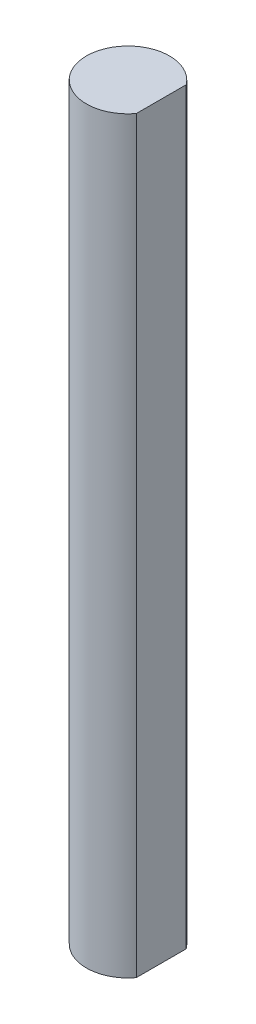
ISO-10303-21;
HEADER;
FILE_DESCRIPTION(('STEP AP214'),'2;1');
FILE_NAME('part.step','',(''),(''),'','','');
FILE_SCHEMA(('AUTOMOTIVE_DESIGN { 1 0 10303 214 1 1 1 1 }'));
ENDSEC;
DATA;
#1=APPLICATION_CONTEXT('core data for automotive mechanical design processes');
#2=APPLICATION_PROTOCOL_DEFINITION('international standard','automotive_design',2000,#1);
#3=PRODUCT_CONTEXT('',#1,'mechanical');
#4=PRODUCT('Part','Part','',(#3));
#5=PRODUCT_RELATED_PRODUCT_CATEGORY('part','',(#4));
#6=PRODUCT_DEFINITION_FORMATION('','',#4);
#7=PRODUCT_DEFINITION_CONTEXT('part definition',#1,'design');
#8=PRODUCT_DEFINITION('design','',#6,#7);
#9=PRODUCT_DEFINITION_SHAPE('','',#8);
#10=(LENGTH_UNIT() NAMED_UNIT(*) SI_UNIT(.MILLI.,.METRE.));
#11=(NAMED_UNIT(*) PLANE_ANGLE_UNIT() SI_UNIT($,.RADIAN.));
#12=(NAMED_UNIT(*) SI_UNIT($,.STERADIAN.) SOLID_ANGLE_UNIT());
#13=UNCERTAINTY_MEASURE_WITH_UNIT(LENGTH_MEASURE(1.E-05),#10,'distance_accuracy_value','');
#14=(GEOMETRIC_REPRESENTATION_CONTEXT(3) GLOBAL_UNCERTAINTY_ASSIGNED_CONTEXT((#13)) GLOBAL_UNIT_ASSIGNED_CONTEXT((#10,
#11,#12)) REPRESENTATION_CONTEXT('',''));
#15=CARTESIAN_POINT('',(0.,0.,0.));
#16=DIRECTION('',(0.,0.,1.));
#17=DIRECTION('',(1.,0.,0.));
#18=AXIS2_PLACEMENT_3D('',#15,#16,#17);
#19=CARTESIAN_POINT('',(0.,57.15,0.));
#20=DIRECTION('',(0.,-1.,0.));
#21=DIRECTION('',(0.,0.,-1.));
#22=AXIS2_PLACEMENT_3D('',#19,#20,#21);
#23=CYLINDRICAL_SURFACE('',#22,3.175);
#24=CARTESIAN_POINT('',(0.,0.,0.));
#25=DIRECTION('',(0.,1.,0.));
#26=DIRECTION('',(0.,0.,1.));
#27=AXIS2_PLACEMENT_3D('',#24,#25,#26);
#28=CIRCLE('',#27,3.175);
#29=CARTESIAN_POINT('',(2.54,0.,-1.905));
#30=VERTEX_POINT('',#29);
#31=CARTESIAN_POINT('',(2.54,0.,1.905));
#32=VERTEX_POINT('',#31);
#33=EDGE_CURVE('E63',#30,#32,#28,.T.);
#34=ORIENTED_EDGE('',*,*,#33,.T.);
#35=DIRECTION('',(0.,-1.,0.));
#36=VECTOR('',#35,1.);
#37=CARTESIAN_POINT('',(2.54,57.15,1.905));
#38=LINE('',#37,#36);
#39=CARTESIAN_POINT('',(2.54,57.15,1.905));
#40=VERTEX_POINT('',#39);
#41=EDGE_CURVE('E11',#40,#32,#38,.T.);
#42=ORIENTED_EDGE('',*,*,#41,.F.);
#43=CARTESIAN_POINT('',(0.,57.15,0.));
#44=DIRECTION('',(0.,1.,0.));
#45=DIRECTION('',(0.,0.,1.));
#46=AXIS2_PLACEMENT_3D('',#43,#44,#45);
#47=CIRCLE('',#46,3.175);
#48=CARTESIAN_POINT('',(2.54,57.15,-1.905));
#49=VERTEX_POINT('',#48);
#50=EDGE_CURVE('E65',#49,#40,#47,.T.);
#51=ORIENTED_EDGE('',*,*,#50,.F.);
#52=DIRECTION('',(0.,-1.,0.));
#53=VECTOR('',#52,1.);
#54=CARTESIAN_POINT('',(2.54,57.15,-1.905));
#55=LINE('',#54,#53);
#56=EDGE_CURVE('E47',#49,#30,#55,.T.);
#57=ORIENTED_EDGE('',*,*,#56,.T.);
#58=EDGE_LOOP('',(#34,#42,#51,#57));
#59=FACE_BOUND('',#58,.T.);
#60=ADVANCED_FACE('F38',(#59),#23,.T.);
#61=CARTESIAN_POINT('',(2.54,57.15,0.));
#62=DIRECTION('',(1.,0.,0.));
#63=DIRECTION('',(0.,0.,-1.));
#64=AXIS2_PLACEMENT_3D('',#61,#62,#63);
#65=PLANE('',#64);
#66=DIRECTION('',(0.,0.,1.));
#67=VECTOR('',#66,1.);
#68=CARTESIAN_POINT('',(2.54,0.,0.));
#69=LINE('',#68,#67);
#70=EDGE_CURVE('E71',#30,#32,#69,.T.);
#71=ORIENTED_EDGE('',*,*,#70,.F.);
#72=ORIENTED_EDGE('',*,*,#56,.F.);
#73=DIRECTION('',(0.,0.,1.));
#74=VECTOR('',#73,1.);
#75=CARTESIAN_POINT('',(2.54,57.15,0.));
#76=LINE('',#75,#74);
#77=EDGE_CURVE('E68',#49,#40,#76,.T.);
#78=ORIENTED_EDGE('',*,*,#77,.T.);
#79=ORIENTED_EDGE('',*,*,#41,.T.);
#80=EDGE_LOOP('',(#71,#72,#78,#79));
#81=FACE_BOUND('',#80,.T.);
#82=ADVANCED_FACE('F74',(#81),#65,.T.);
#83=CARTESIAN_POINT('',(0.,57.15,0.));
#84=DIRECTION('',(0.,1.,0.));
#85=DIRECTION('',(0.,0.,1.));
#86=AXIS2_PLACEMENT_3D('',#83,#84,#85);
#87=PLANE('',#86);
#88=ORIENTED_EDGE('',*,*,#50,.T.);
#89=ORIENTED_EDGE('',*,*,#77,.F.);
#90=EDGE_LOOP('',(#88,#89));
#91=FACE_BOUND('',#90,.T.);
#92=ADVANCED_FACE('F82',(#91),#87,.T.);
#93=CARTESIAN_POINT('',(0.,0.,0.));
#94=DIRECTION('',(0.,1.,0.));
#95=DIRECTION('',(0.,0.,1.));
#96=AXIS2_PLACEMENT_3D('',#93,#94,#95);
#97=PLANE('',#96);
#98=ORIENTED_EDGE('',*,*,#33,.F.);
#99=ORIENTED_EDGE('',*,*,#70,.T.);
#100=EDGE_LOOP('',(#98,#99));
#101=FACE_BOUND('',#100,.T.);
#102=ADVANCED_FACE('F70',(#101),#97,.F.);
#103=CLOSED_SHELL('',(#60,#82,#92,#102));
#104=MANIFOLD_SOLID_BREP('B2',#103);
#105=ADVANCED_BREP_SHAPE_REPRESENTATION('',(#18,#104),#14);
#106=SHAPE_DEFINITION_REPRESENTATION(#9,#105);
ENDSEC;
END-ISO-10303-21;
